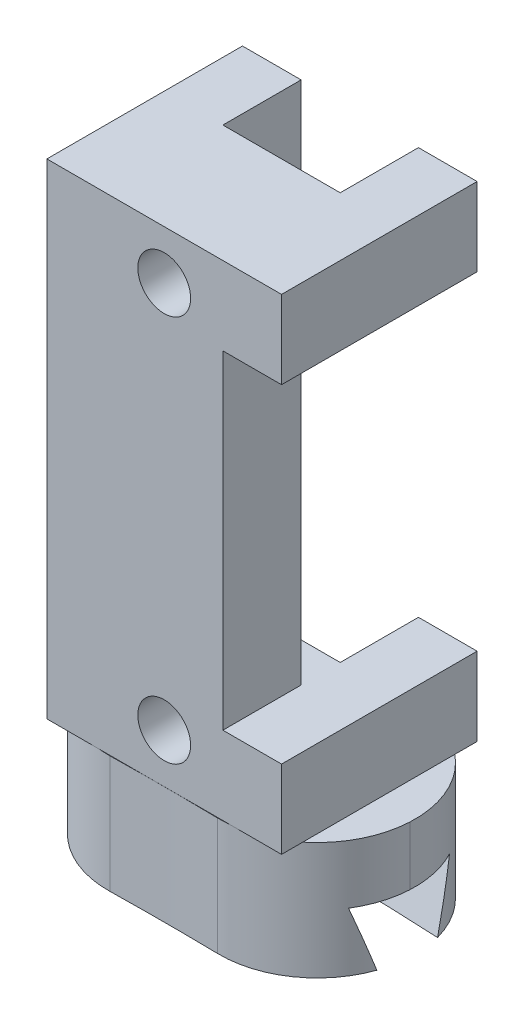
ISO-10303-21;
HEADER;
FILE_DESCRIPTION(('STEP AP214'),'2;1');
FILE_NAME('part.step','',(''),(''),'','','');
FILE_SCHEMA(('AUTOMOTIVE_DESIGN { 1 0 10303 214 1 1 1 1 }'));
ENDSEC;
DATA;
#1=APPLICATION_CONTEXT('core data for automotive mechanical design processes');
#2=APPLICATION_PROTOCOL_DEFINITION('international standard','automotive_design',2000,#1);
#3=PRODUCT_CONTEXT('',#1,'mechanical');
#4=PRODUCT('Part','Part','',(#3));
#5=PRODUCT_RELATED_PRODUCT_CATEGORY('part','',(#4));
#6=PRODUCT_DEFINITION_FORMATION('','',#4);
#7=PRODUCT_DEFINITION_CONTEXT('part definition',#1,'design');
#8=PRODUCT_DEFINITION('design','',#6,#7);
#9=PRODUCT_DEFINITION_SHAPE('','',#8);
#10=(LENGTH_UNIT() NAMED_UNIT(*) SI_UNIT(.MILLI.,.METRE.));
#11=(NAMED_UNIT(*) PLANE_ANGLE_UNIT() SI_UNIT($,.RADIAN.));
#12=(NAMED_UNIT(*) SI_UNIT($,.STERADIAN.) SOLID_ANGLE_UNIT());
#13=UNCERTAINTY_MEASURE_WITH_UNIT(LENGTH_MEASURE(1.E-05),#10,'distance_accuracy_value','');
#14=(GEOMETRIC_REPRESENTATION_CONTEXT(3) GLOBAL_UNCERTAINTY_ASSIGNED_CONTEXT((#13)) GLOBAL_UNIT_ASSIGNED_CONTEXT((#10,
#11,#12)) REPRESENTATION_CONTEXT('',''));
#15=CARTESIAN_POINT('',(0.,0.,0.));
#16=DIRECTION('',(0.,0.,1.));
#17=DIRECTION('',(1.,0.,0.));
#18=AXIS2_PLACEMENT_3D('',#15,#16,#17);
#19=CARTESIAN_POINT('',(7.77188950207718,-5.99999999999999,-148.296485911054));
#20=DIRECTION('',(0.,1.,0.));
#21=DIRECTION('',(0.,0.,1.));
#22=AXIS2_PLACEMENT_3D('',#19,#20,#21);
#23=PLANE('',#22);
#24=CARTESIAN_POINT('',(0.,-5.99999999999999,0.));
#25=DIRECTION('',(0.,1.,0.));
#26=DIRECTION('',(0.,0.,1.));
#27=AXIS2_PLACEMENT_3D('',#24,#25,#26);
#28=CIRCLE('',#27,148.5);
#29=CARTESIAN_POINT('',(7.56723547450989,-5.99999999999999,-148.307069781832));
#30=VERTEX_POINT('',#29);
#31=CARTESIAN_POINT('',(-7.56723547450992,-5.99999999999999,-148.307069781832));
#32=VERTEX_POINT('',#31);
#33=EDGE_CURVE('E253',#30,#32,#28,.T.);
#34=ORIENTED_EDGE('',*,*,#33,.F.);
#35=CARTESIAN_POINT('',(2.85288322082783,-5.99999999999999,-149.972867737229));
#36=DIRECTION('',(0.,1.,0.));
#37=DIRECTION('',(0.,0.,1.));
#38=AXIS2_PLACEMENT_3D('',#35,#36,#37);
#39=CIRCLE('',#38,5.);
#40=CARTESIAN_POINT('',(2.7577871134669,-5.99999999999999,-144.973772145988));
#41=VERTEX_POINT('',#40);
#42=EDGE_CURVE('E67',#30,#41,#39,.F.);
#43=ORIENTED_EDGE('',*,*,#42,.T.);
#44=CARTESIAN_POINT('',(0.,-5.99999999999999,0.));
#45=DIRECTION('',(0.,1.,0.));
#46=DIRECTION('',(0.,0.,1.));
#47=AXIS2_PLACEMENT_3D('',#44,#45,#46);
#48=CIRCLE('',#47,145.);
#49=CARTESIAN_POINT('',(-2.7577871134669,-5.99999999999999,-144.973772145988));
#50=VERTEX_POINT('',#49);
#51=EDGE_CURVE('E124',#41,#50,#48,.T.);
#52=ORIENTED_EDGE('',*,*,#51,.T.);
#53=CARTESIAN_POINT('',(-2.85288322082783,-5.99999999999999,-149.972867737229));
#54=DIRECTION('',(0.,1.,0.));
#55=DIRECTION('',(0.,0.,1.));
#56=AXIS2_PLACEMENT_3D('',#53,#54,#55);
#57=CIRCLE('',#56,5.);
#58=EDGE_CURVE('E205',#50,#32,#57,.F.);
#59=ORIENTED_EDGE('',*,*,#58,.T.);
#60=EDGE_LOOP('',(#34,#43,#52,#59));
#61=FACE_BOUND('',#60,.T.);
#62=ADVANCED_FACE('F43',(#61),#23,.F.);
#63=CARTESIAN_POINT('',(0.,-5.99999999999999,0.));
#64=DIRECTION('',(0.,-1.,0.));
#65=DIRECTION('',(0.,0.,-1.));
#66=AXIS2_PLACEMENT_3D('',#63,#64,#65);
#67=CONICAL_SURFACE('',#66,148.5,0.321750554396643);
#68=CARTESIAN_POINT('',(0.,-2.99999999999999,0.));
#69=DIRECTION('',(0.,1.,0.));
#70=DIRECTION('',(0.,0.,1.));
#71=AXIS2_PLACEMENT_3D('',#68,#69,#70);
#72=CIRCLE('',#71,147.5);
#73=CARTESIAN_POINT('',(7.09680598545688,-2.99999999999999,-147.329173434201));
#74=VERTEX_POINT('',#73);
#75=CARTESIAN_POINT('',(-7.09680598545634,-2.99999999999999,-147.329173434201));
#76=VERTEX_POINT('',#75);
#77=EDGE_CURVE('E247',#74,#76,#72,.T.);
#78=ORIENTED_EDGE('',*,*,#77,.F.);
#79=CARTESIAN_POINT('',(7.09680598545688,-2.99999999999999,-147.329173434201));
#80=CARTESIAN_POINT('',(7.14694345753966,-3.24849777765476,-147.409686408016));
#81=CARTESIAN_POINT('',(7.19411464656061,-3.49749111640178,-147.490487021504));
#82=CARTESIAN_POINT('',(7.28287122221701,-3.99620367637286,-147.652571102377));
#83=CARTESIAN_POINT('',(7.32445882203517,-4.24592256966958,-147.733854365035));
#84=CARTESIAN_POINT('',(7.40243378589243,-4.74601575726446,-147.896874424309));
#85=CARTESIAN_POINT('',(7.43882121411936,-4.99639004343397,-147.978611215316));
#86=CARTESIAN_POINT('',(7.50666706111707,-5.49777389944254,-148.14252749319));
#87=CARTESIAN_POINT('',(7.53812351441111,-5.74878368228539,-148.224707143148));
#88=CARTESIAN_POINT('',(7.56723547450992,-5.99999999999999,-148.307069781832));
#89=B_SPLINE_CURVE_WITH_KNOTS('',3,(#79,#80,#81,#82,#83,#84,#85,#86,#87,#88),.UNSPECIFIED.,.F.,
.F.,(4,2,2,2,4),(0.,0.797920321275331,1.59552342901255,2.39311669075938,3.19102706758133),.UNSPECIFIED.);
#90=EDGE_CURVE('E200',#74,#30,#89,.T.);
#91=ORIENTED_EDGE('',*,*,#90,.T.);
#92=ORIENTED_EDGE('',*,*,#33,.T.);
#93=CARTESIAN_POINT('',(-7.56723547450992,-5.99999999999999,-148.307069781832));
#94=CARTESIAN_POINT('',(-7.53812351441111,-5.74878368228539,-148.224707143148));
#95=CARTESIAN_POINT('',(-7.50666706111707,-5.49777389944255,-148.14252749319));
#96=CARTESIAN_POINT('',(-7.43882121411936,-4.99639004343398,-147.978611215316));
#97=CARTESIAN_POINT('',(-7.40243378589243,-4.74601575726446,-147.896874424309));
#98=CARTESIAN_POINT('',(-7.32445882203517,-4.24592256966958,-147.733854365035));
#99=CARTESIAN_POINT('',(-7.28287122221701,-3.99620367637286,-147.652571102377));
#100=CARTESIAN_POINT('',(-7.19411464656061,-3.49749111640178,-147.490487021504));
#101=CARTESIAN_POINT('',(-7.14694345753966,-3.24849777765476,-147.409686408016));
#102=CARTESIAN_POINT('',(-7.09680598545689,-2.99999999999998,-147.329173434201));
#103=B_SPLINE_CURVE_WITH_KNOTS('',3,(#93,#94,#95,#96,#97,#98,#99,#100,#101,#102),.UNSPECIFIED.,
.F.,.F.,(4,2,2,2,4),(0.,0.797910376821949,1.59550363856878,2.393106746306,3.19102706758133),.UNSPECIFIED.);
#104=EDGE_CURVE('E194',#32,#76,#103,.T.);
#105=ORIENTED_EDGE('',*,*,#104,.T.);
#106=EDGE_LOOP('',(#78,#91,#92,#105));
#107=FACE_BOUND('',#106,.T.);
#108=ADVANCED_FACE('F185',(#107),#67,.T.);
#109=CARTESIAN_POINT('',(7.98123332704895,-2.99999999999999,-152.291004050073));
#110=DIRECTION('',(0.,1.,0.));
#111=DIRECTION('',(0.,0.,1.));
#112=AXIS2_PLACEMENT_3D('',#109,#110,#111);
#113=PLANE('',#112);
#114=CARTESIAN_POINT('',(0.,-2.99999999999999,0.));
#115=DIRECTION('',(0.,1.,0.));
#116=DIRECTION('',(0.,0.,1.));
#117=AXIS2_PLACEMENT_3D('',#114,#115,#116);
#118=CIRCLE('',#117,152.5);
#119=CARTESIAN_POINT('',(7.26406784686396,-2.99999999999999,-152.326896240671));
#120=VERTEX_POINT('',#119);
#121=CARTESIAN_POINT('',(-7.26406784686442,-2.99999999999999,-152.326896240671));
#122=VERTEX_POINT('',#121);
#123=EDGE_CURVE('E245',#120,#122,#118,.T.);
#124=ORIENTED_EDGE('',*,*,#123,.F.);
#125=CARTESIAN_POINT('',(2.85288322082783,-2.99999999999999,-149.972867737229));
#126=DIRECTION('',(0.,1.,0.));
#127=DIRECTION('',(0.,0.,1.));
#128=AXIS2_PLACEMENT_3D('',#125,#126,#127);
#129=CIRCLE('',#128,5.);
#130=CARTESIAN_POINT('',(7.8460308946007,-2.99999999999999,-149.711187956014));
#131=VERTEX_POINT('',#130);
#132=EDGE_CURVE('E262',#120,#131,#129,.F.);
#133=ORIENTED_EDGE('',*,*,#132,.T.);
#134=CARTESIAN_POINT('',(2.85288322082783,-2.99999999999999,-149.972867737229));
#135=DIRECTION('',(0.,1.,0.));
#136=DIRECTION('',(0.,0.,1.));
#137=AXIS2_PLACEMENT_3D('',#134,#135,#136);
#138=CIRCLE('',#137,5.);
#139=EDGE_CURVE('E263',#131,#74,#138,.F.);
#140=ORIENTED_EDGE('',*,*,#139,.T.);
#141=ORIENTED_EDGE('',*,*,#77,.T.);
#142=CARTESIAN_POINT('',(-2.85288322082783,-2.99999999999999,-149.972867737229));
#143=DIRECTION('',(0.,1.,0.));
#144=DIRECTION('',(0.,0.,1.));
#145=AXIS2_PLACEMENT_3D('',#142,#143,#144);
#146=CIRCLE('',#145,5.);
#147=CARTESIAN_POINT('',(-7.8460308946007,-2.99999999999999,-149.711187956014));
#148=VERTEX_POINT('',#147);
#149=EDGE_CURVE('E261',#76,#148,#146,.F.);
#150=ORIENTED_EDGE('',*,*,#149,.T.);
#151=CARTESIAN_POINT('',(-2.85288322082783,-2.99999999999999,-149.972867737229));
#152=DIRECTION('',(0.,1.,0.));
#153=DIRECTION('',(0.,0.,1.));
#154=AXIS2_PLACEMENT_3D('',#151,#152,#153);
#155=CIRCLE('',#154,5.);
#156=EDGE_CURVE('E264',#148,#122,#155,.F.);
#157=ORIENTED_EDGE('',*,*,#156,.T.);
#158=EDGE_LOOP('',(#124,#133,#140,#141,#150,#157));
#159=FACE_BOUND('',#158,.T.);
#160=ADVANCED_FACE('F179',(#159),#113,.F.);
#161=CARTESIAN_POINT('',(0.,-2.99999999999999,0.));
#162=DIRECTION('',(0.,1.,0.));
#163=DIRECTION('',(0.,0.,1.));
#164=AXIS2_PLACEMENT_3D('',#161,#162,#163);
#165=CONICAL_SURFACE('',#164,152.5,0.321750554396643);
#166=CARTESIAN_POINT('',(0.,-5.99999999999999,0.));
#167=DIRECTION('',(0.,1.,0.));
#168=DIRECTION('',(0.,0.,1.));
#169=AXIS2_PLACEMENT_3D('',#166,#167,#168);
#170=CIRCLE('',#169,151.5);
#171=CARTESIAN_POINT('',(7.67198809641304,-5.99999999999999,-151.305619851506));
#172=VERTEX_POINT('',#171);
#173=CARTESIAN_POINT('',(-7.67198809641301,-5.99999999999999,-151.305619851506));
#174=VERTEX_POINT('',#173);
#175=EDGE_CURVE('E240',#172,#174,#170,.T.);
#176=ORIENTED_EDGE('',*,*,#175,.F.);
#177=CARTESIAN_POINT('',(7.67198809641304,-5.99999999999999,-151.305619851506));
#178=CARTESIAN_POINT('',(7.64844865757106,-5.74865741107548,-151.390701569956));
#179=CARTESIAN_POINT('',(7.62249227862881,-5.49754811119247,-151.475821006032));
#180=CARTESIAN_POINT('',(7.56547321684159,-4.99603130632236,-151.646060102086));
#181=CARTESIAN_POINT('',(7.53441270686926,-4.74562354861906,-151.731179746622));
#182=CARTESIAN_POINT('',(7.46689298625176,-4.2455279364022,-151.901417540359));
#183=CARTESIAN_POINT('',(7.43043370124475,-3.99584009185291,-151.986535689522));
#184=CARTESIAN_POINT('',(7.35170588307958,-3.49725585456789,-152.156752708309));
#185=CARTESIAN_POINT('',(7.30943488801477,-3.24835984322292,-152.241851554372));
#186=CARTESIAN_POINT('',(7.26406784686443,-2.99999999999998,-152.326896240671));
#187=B_SPLINE_CURVE_WITH_KNOTS('',3,(#177,#178,#179,#180,#181,#182,#183,#184,#185,#186),
.UNSPECIFIED.,.F.,.F.,(4,2,2,2,4),(0.,0.799180599717231,1.5980218585563,2.39687412152819,
3.19606583610794),.UNSPECIFIED.);
#188=EDGE_CURVE('E164',#172,#120,#187,.T.);
#189=ORIENTED_EDGE('',*,*,#188,.T.);
#190=ORIENTED_EDGE('',*,*,#123,.T.);
#191=CARTESIAN_POINT('',(-7.26406784686442,-2.99999999999999,-152.326896240671));
#192=CARTESIAN_POINT('',(-7.30943488801477,-3.24835984322292,-152.241851554372));
#193=CARTESIAN_POINT('',(-7.35170588307958,-3.4972558545679,-152.156752708309));
#194=CARTESIAN_POINT('',(-7.43043370124475,-3.99584009185291,-151.986535689522));
#195=CARTESIAN_POINT('',(-7.46689298625176,-4.2455279364022,-151.901417540359));
#196=CARTESIAN_POINT('',(-7.53441270686926,-4.74562354861906,-151.731179746622));
#197=CARTESIAN_POINT('',(-7.56547321684159,-4.99603130632237,-151.646060102086));
#198=CARTESIAN_POINT('',(-7.62249227862881,-5.49754811119247,-151.475821006032));
#199=CARTESIAN_POINT('',(-7.64844865757106,-5.74865741107547,-151.390701569956));
#200=CARTESIAN_POINT('',(-7.67198809641305,-5.99999999999998,-151.305619851506));
#201=B_SPLINE_CURVE_WITH_KNOTS('',3,(#191,#192,#193,#194,#195,#196,#197,#198,#199,#200),
.UNSPECIFIED.,.F.,.F.,(4,2,2,2,4),(0.,0.79919171457975,1.59804397755164,2.39688523639071,
3.19606583610793),.UNSPECIFIED.);
#202=EDGE_CURVE('E158',#122,#174,#201,.T.);
#203=ORIENTED_EDGE('',*,*,#202,.T.);
#204=EDGE_LOOP('',(#176,#189,#190,#203));
#205=FACE_BOUND('',#204,.T.);
#206=ADVANCED_FACE('F173',(#205),#165,.F.);
#207=CARTESIAN_POINT('',(7.92889737080601,-5.99999999999999,-151.292374515318));
#208=DIRECTION('',(0.,1.,0.));
#209=DIRECTION('',(0.,0.,1.));
#210=AXIS2_PLACEMENT_3D('',#207,#208,#209);
#211=PLANE('',#210);
#212=CARTESIAN_POINT('',(0.,-5.99999999999999,0.));
#213=DIRECTION('',(0.,1.,0.));
#214=DIRECTION('',(0.,0.,1.));
#215=AXIS2_PLACEMENT_3D('',#212,#213,#214);
#216=CIRCLE('',#215,155.);
#217=CARTESIAN_POINT('',(2.94797932818876,-5.99999999999999,-154.97196332847));
#218=VERTEX_POINT('',#217);
#219=CARTESIAN_POINT('',(-2.94797932818876,-5.99999999999999,-154.97196332847));
#220=VERTEX_POINT('',#219);
#221=EDGE_CURVE('E234',#218,#220,#216,.T.);
#222=ORIENTED_EDGE('',*,*,#221,.F.);
#223=CARTESIAN_POINT('',(2.85288322082783,-5.99999999999999,-149.972867737229));
#224=DIRECTION('',(0.,1.,0.));
#225=DIRECTION('',(0.,0.,1.));
#226=AXIS2_PLACEMENT_3D('',#223,#224,#225);
#227=CIRCLE('',#226,5.);
#228=EDGE_CURVE('E156',#218,#172,#227,.F.);
#229=ORIENTED_EDGE('',*,*,#228,.T.);
#230=ORIENTED_EDGE('',*,*,#175,.T.);
#231=CARTESIAN_POINT('',(-2.85288322082783,-5.99999999999999,-149.972867737229));
#232=DIRECTION('',(0.,1.,0.));
#233=DIRECTION('',(0.,0.,1.));
#234=AXIS2_PLACEMENT_3D('',#231,#232,#233);
#235=CIRCLE('',#234,5.);
#236=EDGE_CURVE('E154',#174,#220,#235,.F.);
#237=ORIENTED_EDGE('',*,*,#236,.T.);
#238=EDGE_LOOP('',(#222,#229,#230,#237));
#239=FACE_BOUND('',#238,.T.);
#240=ADVANCED_FACE('F178',(#239),#211,.F.);
#241=CARTESIAN_POINT('',(0.,11.,0.));
#242=DIRECTION('',(0.,1.,0.));
#243=DIRECTION('',(0.,0.,1.));
#244=AXIS2_PLACEMENT_3D('',#241,#242,#243);
#245=CYLINDRICAL_SURFACE('',#244,155.);
#246=CARTESIAN_POINT('',(0.,0.,0.));
#247=DIRECTION('',(0.,1.,0.));
#248=DIRECTION('',(0.,0.,1.));
#249=AXIS2_PLACEMENT_3D('',#246,#247,#248);
#250=CIRCLE('',#249,155.);
#251=CARTESIAN_POINT('',(2.94797932818876,0.,-154.97196332847));
#252=VERTEX_POINT('',#251);
#253=CARTESIAN_POINT('',(-2.94797932818876,0.,-154.97196332847));
#254=VERTEX_POINT('',#253);
#255=EDGE_CURVE('E133',#252,#254,#250,.T.);
#256=ORIENTED_EDGE('',*,*,#255,.F.);
#257=DIRECTION('',(0.,1.,0.));
#258=VECTOR('',#257,1.);
#259=CARTESIAN_POINT('',(2.94797932818876,11.,-154.97196332847));
#260=LINE('',#259,#258);
#261=EDGE_CURVE('E151',#252,#218,#260,.F.);
#262=ORIENTED_EDGE('',*,*,#261,.T.);
#263=ORIENTED_EDGE('',*,*,#221,.T.);
#264=DIRECTION('',(0.,1.,0.));
#265=VECTOR('',#264,1.);
#266=CARTESIAN_POINT('',(-2.94797932818876,11.,-154.97196332847));
#267=LINE('',#266,#265);
#268=EDGE_CURVE('E144',#220,#254,#267,.T.);
#269=ORIENTED_EDGE('',*,*,#268,.T.);
#270=EDGE_LOOP('',(#256,#262,#263,#269));
#271=FACE_BOUND('',#270,.T.);
#272=ADVANCED_FACE('F221',(#271),#245,.T.);
#273=CARTESIAN_POINT('',(8.11207321765631,0.,-154.787577886959));
#274=DIRECTION('',(0.,-1.,0.));
#275=DIRECTION('',(0.,0.,-1.));
#276=AXIS2_PLACEMENT_3D('',#273,#274,#275);
#277=PLANE('',#276);
#278=CARTESIAN_POINT('',(2.85288322082783,0.,-149.972867737229));
#279=DIRECTION('',(0.,-1.,0.));
#280=DIRECTION('',(0.,0.,-1.));
#281=AXIS2_PLACEMENT_3D('',#278,#279,#280);
#282=CIRCLE('',#281,5.);
#283=CARTESIAN_POINT('',(2.7577871134669,0.,-144.973772145988));
#284=VERTEX_POINT('',#283);
#285=CARTESIAN_POINT('',(7.8460308946007,0.,-149.711187956014));
#286=VERTEX_POINT('',#285);
#287=EDGE_CURVE('E129',#284,#286,#282,.F.);
#288=ORIENTED_EDGE('',*,*,#287,.T.);
#289=CARTESIAN_POINT('',(2.85288322082783,0.,-149.972867737229));
#290=DIRECTION('',(0.,-1.,0.));
#291=DIRECTION('',(0.,0.,-1.));
#292=AXIS2_PLACEMENT_3D('',#289,#290,#291);
#293=CIRCLE('',#292,5.);
#294=EDGE_CURVE('E141',#286,#252,#293,.F.);
#295=ORIENTED_EDGE('',*,*,#294,.T.);
#296=ORIENTED_EDGE('',*,*,#255,.T.);
#297=CARTESIAN_POINT('',(-2.85288322082783,0.,-149.972867737229));
#298=DIRECTION('',(0.,-1.,0.));
#299=DIRECTION('',(0.,0.,-1.));
#300=AXIS2_PLACEMENT_3D('',#297,#298,#299);
#301=CIRCLE('',#300,5.);
#302=CARTESIAN_POINT('',(-7.8460308946007,0.,-149.711187956014));
#303=VERTEX_POINT('',#302);
#304=EDGE_CURVE('E142',#254,#303,#301,.F.);
#305=ORIENTED_EDGE('',*,*,#304,.T.);
#306=CARTESIAN_POINT('',(-2.85288322082783,0.,-149.972867737229));
#307=DIRECTION('',(0.,-1.,0.));
#308=DIRECTION('',(0.,0.,-1.));
#309=AXIS2_PLACEMENT_3D('',#306,#307,#308);
#310=CIRCLE('',#309,5.);
#311=CARTESIAN_POINT('',(-2.7577871134669,0.,-144.973772145988));
#312=VERTEX_POINT('',#311);
#313=EDGE_CURVE('E132',#303,#312,#310,.F.);
#314=ORIENTED_EDGE('',*,*,#313,.T.);
#315=CARTESIAN_POINT('',(0.,0.,0.));
#316=DIRECTION('',(0.,1.,0.));
#317=DIRECTION('',(0.,0.,1.));
#318=AXIS2_PLACEMENT_3D('',#315,#316,#317);
#319=CIRCLE('',#318,145.);
#320=EDGE_CURVE('E123',#284,#312,#319,.T.);
#321=ORIENTED_EDGE('',*,*,#320,.F.);
#322=EDGE_LOOP('',(#288,#295,#296,#305,#314,#321));
#323=FACE_BOUND('',#322,.T.);
#324=ADVANCED_FACE('F128',(#323),#277,.F.);
#325=CARTESIAN_POINT('',(0.,11.,0.));
#326=DIRECTION('',(0.,1.,0.));
#327=DIRECTION('',(0.,0.,1.));
#328=AXIS2_PLACEMENT_3D('',#325,#326,#327);
#329=CYLINDRICAL_SURFACE('',#328,145.);
#330=ORIENTED_EDGE('',*,*,#51,.F.);
#331=DIRECTION('',(0.,1.,0.));
#332=VECTOR('',#331,1.);
#333=CARTESIAN_POINT('',(2.7577871134669,11.,-144.973772145988));
#334=LINE('',#333,#332);
#335=EDGE_CURVE('E12',#41,#284,#334,.T.);
#336=ORIENTED_EDGE('',*,*,#335,.T.);
#337=ORIENTED_EDGE('',*,*,#320,.T.);
#338=DIRECTION('',(0.,1.,0.));
#339=VECTOR('',#338,1.);
#340=CARTESIAN_POINT('',(-2.7577871134669,11.,-144.973772145988));
#341=LINE('',#340,#339);
#342=EDGE_CURVE('E53',#312,#50,#341,.F.);
#343=ORIENTED_EDGE('',*,*,#342,.T.);
#344=EDGE_LOOP('',(#330,#336,#337,#343));
#345=FACE_BOUND('',#344,.T.);
#346=ADVANCED_FACE('F122',(#345),#329,.F.);
#347=CARTESIAN_POINT('',(2.85288322082783,11.,-149.972867737229));
#348=DIRECTION('',(0.,1.,0.));
#349=DIRECTION('',(0.,0.,1.));
#350=AXIS2_PLACEMENT_3D('',#347,#348,#349);
#351=CYLINDRICAL_SURFACE('',#350,5.);
#352=ORIENTED_EDGE('',*,*,#90,.F.);
#353=ORIENTED_EDGE('',*,*,#139,.F.);
#354=DIRECTION('',(0.,-1.,0.));
#355=VECTOR('',#354,1.);
#356=CARTESIAN_POINT('',(7.8460308946007,-5.99999999999999,-149.711187956014));
#357=LINE('',#356,#355);
#358=EDGE_CURVE('E139',#286,#131,#357,.T.);
#359=ORIENTED_EDGE('',*,*,#358,.F.);
#360=ORIENTED_EDGE('',*,*,#287,.F.);
#361=ORIENTED_EDGE('',*,*,#335,.F.);
#362=ORIENTED_EDGE('',*,*,#42,.F.);
#363=EDGE_LOOP('',(#352,#353,#359,#360,#361,#362));
#364=FACE_BOUND('',#363,.T.);
#365=ADVANCED_FACE('F136',(#364),#351,.T.);
#366=CARTESIAN_POINT('',(2.85288322082783,11.,-149.972867737229));
#367=DIRECTION('',(0.,1.,0.));
#368=DIRECTION('',(0.,0.,1.));
#369=AXIS2_PLACEMENT_3D('',#366,#367,#368);
#370=CYLINDRICAL_SURFACE('',#369,5.);
#371=ORIENTED_EDGE('',*,*,#228,.F.);
#372=ORIENTED_EDGE('',*,*,#261,.F.);
#373=ORIENTED_EDGE('',*,*,#294,.F.);
#374=ORIENTED_EDGE('',*,*,#358,.T.);
#375=ORIENTED_EDGE('',*,*,#132,.F.);
#376=ORIENTED_EDGE('',*,*,#188,.F.);
#377=EDGE_LOOP('',(#371,#372,#373,#374,#375,#376));
#378=FACE_BOUND('',#377,.T.);
#379=ADVANCED_FACE('F190',(#378),#370,.T.);
#380=CARTESIAN_POINT('',(-2.85288322082783,11.,-149.972867737229));
#381=DIRECTION('',(0.,1.,0.));
#382=DIRECTION('',(0.,0.,1.));
#383=AXIS2_PLACEMENT_3D('',#380,#381,#382);
#384=CYLINDRICAL_SURFACE('',#383,5.);
#385=DIRECTION('',(0.,1.,0.));
#386=VECTOR('',#385,1.);
#387=CARTESIAN_POINT('',(-7.8460308946007,0.,-149.711187956014));
#388=LINE('',#387,#386);
#389=EDGE_CURVE('E48',#148,#303,#388,.T.);
#390=ORIENTED_EDGE('',*,*,#389,.F.);
#391=ORIENTED_EDGE('',*,*,#149,.F.);
#392=ORIENTED_EDGE('',*,*,#104,.F.);
#393=ORIENTED_EDGE('',*,*,#58,.F.);
#394=ORIENTED_EDGE('',*,*,#342,.F.);
#395=ORIENTED_EDGE('',*,*,#313,.F.);
#396=EDGE_LOOP('',(#390,#391,#392,#393,#394,#395));
#397=FACE_BOUND('',#396,.T.);
#398=ADVANCED_FACE('F45',(#397),#384,.T.);
#399=CARTESIAN_POINT('',(-2.85288322082783,11.,-149.972867737229));
#400=DIRECTION('',(0.,1.,0.));
#401=DIRECTION('',(0.,0.,1.));
#402=AXIS2_PLACEMENT_3D('',#399,#400,#401);
#403=CYLINDRICAL_SURFACE('',#402,5.);
#404=ORIENTED_EDGE('',*,*,#156,.F.);
#405=ORIENTED_EDGE('',*,*,#389,.T.);
#406=ORIENTED_EDGE('',*,*,#304,.F.);
#407=ORIENTED_EDGE('',*,*,#268,.F.);
#408=ORIENTED_EDGE('',*,*,#236,.F.);
#409=ORIENTED_EDGE('',*,*,#202,.F.);
#410=EDGE_LOOP('',(#404,#405,#406,#407,#408,#409));
#411=FACE_BOUND('',#410,.T.);
#412=ADVANCED_FACE('F170',(#411),#403,.T.);
#413=CLOSED_SHELL('',(#62,#108,#160,#206,#240,#272,#324,#346,#365,#379,#398,#412));
#414=MANIFOLD_SOLID_BREP('B2',#413);
#415=CARTESIAN_POINT('',(6.,24.8,-145.));
#416=DIRECTION('',(-1.,0.,0.));
#417=DIRECTION('',(0.,-1.,0.));
#418=AXIS2_PLACEMENT_3D('',#415,#416,#417);
#419=PLANE('',#418);
#420=DIRECTION('',(0.,1.,0.));
#421=VECTOR('',#420,1.);
#422=CARTESIAN_POINT('',(6.,24.8,-145.));
#423=LINE('',#422,#421);
#424=CARTESIAN_POINT('',(6.,20.8,-145.));
#425=VERTEX_POINT('',#424);
#426=CARTESIAN_POINT('',(6.,24.8,-145.));
#427=VERTEX_POINT('',#426);
#428=EDGE_CURVE('E516',#425,#427,#423,.T.);
#429=ORIENTED_EDGE('',*,*,#428,.F.);
#430=DIRECTION('',(0.,0.,1.));
#431=VECTOR('',#430,1.);
#432=CARTESIAN_POINT('',(6.,20.8,-149.));
#433=LINE('',#432,#431);
#434=CARTESIAN_POINT('',(6.,20.8,-155.));
#435=VERTEX_POINT('',#434);
#436=EDGE_CURVE('E568',#435,#425,#433,.T.);
#437=ORIENTED_EDGE('',*,*,#436,.F.);
#438=DIRECTION('',(0.,1.,0.));
#439=VECTOR('',#438,1.);
#440=CARTESIAN_POINT('',(6.,24.8,-155.));
#441=LINE('',#440,#439);
#442=CARTESIAN_POINT('',(6.,24.8,-155.));
#443=VERTEX_POINT('',#442);
#444=EDGE_CURVE('E530',#435,#443,#441,.T.);
#445=ORIENTED_EDGE('',*,*,#444,.T.);
#446=DIRECTION('',(0.,0.,-1.));
#447=VECTOR('',#446,1.);
#448=CARTESIAN_POINT('',(6.,24.8,-145.));
#449=LINE('',#448,#447);
#450=EDGE_CURVE('E539',#427,#443,#449,.T.);
#451=ORIENTED_EDGE('',*,*,#450,.F.);
#452=EDGE_LOOP('',(#429,#437,#445,#451));
#453=FACE_BOUND('',#452,.T.);
#454=ADVANCED_FACE('F343',(#453),#419,.F.);
#455=CARTESIAN_POINT('',(0.,0.,-155.));
#456=DIRECTION('',(0.,0.,1.));
#457=DIRECTION('',(1.,0.,0.));
#458=AXIS2_PLACEMENT_3D('',#455,#456,#457);
#459=PLANE('',#458);
#460=DIRECTION('',(1.,0.,0.));
#461=VECTOR('',#460,1.);
#462=CARTESIAN_POINT('',(-6.,20.8,-155.));
#463=LINE('',#462,#461);
#464=CARTESIAN_POINT('',(3.,20.8,-155.));
#465=VERTEX_POINT('',#464);
#466=EDGE_CURVE('E559',#465,#435,#463,.T.);
#467=ORIENTED_EDGE('',*,*,#466,.F.);
#468=DIRECTION('',(0.,-1.,0.));
#469=VECTOR('',#468,1.);
#470=CARTESIAN_POINT('',(3.,24.8,-155.));
#471=LINE('',#470,#469);
#472=CARTESIAN_POINT('',(3.,24.8,-155.));
#473=VERTEX_POINT('',#472);
#474=EDGE_CURVE('E603',#473,#465,#471,.T.);
#475=ORIENTED_EDGE('',*,*,#474,.F.);
#476=DIRECTION('',(-1.,0.,0.));
#477=VECTOR('',#476,1.);
#478=CARTESIAN_POINT('',(-6.,24.8,-155.));
#479=LINE('',#478,#477);
#480=EDGE_CURVE('E514',#443,#473,#479,.T.);
#481=ORIENTED_EDGE('',*,*,#480,.F.);
#482=ORIENTED_EDGE('',*,*,#444,.F.);
#483=EDGE_LOOP('',(#467,#475,#481,#482));
#484=FACE_BOUND('',#483,.T.);
#485=ADVANCED_FACE('F665',(#484),#459,.F.);
#486=DIRECTION('',(1.,0.,0.));
#487=VECTOR('',#486,1.);
#488=CARTESIAN_POINT('',(-6.,0.,-155.));
#489=LINE('',#488,#487);
#490=CARTESIAN_POINT('',(3.,0.,-155.));
#491=VERTEX_POINT('',#490);
#492=CARTESIAN_POINT('',(6.,0.,-155.));
#493=VERTEX_POINT('',#492);
#494=EDGE_CURVE('E526',#491,#493,#489,.T.);
#495=ORIENTED_EDGE('',*,*,#494,.F.);
#496=CARTESIAN_POINT('',(3.,4.00000000000001,-155.));
#497=VERTEX_POINT('',#496);
#498=EDGE_CURVE('E605',#497,#491,#471,.T.);
#499=ORIENTED_EDGE('',*,*,#498,.F.);
#500=DIRECTION('',(1.,0.,0.));
#501=VECTOR('',#500,1.);
#502=CARTESIAN_POINT('',(-6.00000000000001,4.,-155.));
#503=LINE('',#502,#501);
#504=CARTESIAN_POINT('',(6.,4.00000000000001,-155.));
#505=VERTEX_POINT('',#504);
#506=EDGE_CURVE('E494',#497,#505,#503,.T.);
#507=ORIENTED_EDGE('',*,*,#506,.T.);
#508=EDGE_CURVE('E531',#493,#505,#441,.T.);
#509=ORIENTED_EDGE('',*,*,#508,.F.);
#510=EDGE_LOOP('',(#495,#499,#507,#509));
#511=FACE_BOUND('',#510,.T.);
#512=ADVANCED_FACE('F631',(#511),#459,.F.);
#513=CARTESIAN_POINT('',(0.,22.3,-155.));
#514=DIRECTION('',(0.,0.,1.));
#515=DIRECTION('',(1.,0.,0.));
#516=AXIS2_PLACEMENT_3D('',#513,#514,#515);
#517=CYLINDRICAL_SURFACE('',#516,1.35);
#518=CARTESIAN_POINT('',(0.,22.3,-145.));
#519=DIRECTION('',(0.,0.,1.));
#520=DIRECTION('',(1.,0.,0.));
#521=AXIS2_PLACEMENT_3D('',#518,#519,#520);
#522=CIRCLE('',#521,1.35);
#523=CARTESIAN_POINT('',(1.35,22.3,-145.));
#524=VERTEX_POINT('',#523);
#525=EDGE_CURVE('E506',#524,#524,#522,.T.);
#526=ORIENTED_EDGE('',*,*,#525,.T.);
#527=EDGE_LOOP('',(#526));
#528=FACE_BOUND('',#527,.T.);
#529=CARTESIAN_POINT('',(0.,22.3,-151.));
#530=DIRECTION('',(0.,0.,-1.));
#531=DIRECTION('',(-1.,0.,0.));
#532=AXIS2_PLACEMENT_3D('',#529,#530,#531);
#533=CIRCLE('',#532,1.35);
#534=CARTESIAN_POINT('',(-1.35,22.3,-151.));
#535=VERTEX_POINT('',#534);
#536=EDGE_CURVE('E581',#535,#535,#533,.F.);
#537=ORIENTED_EDGE('',*,*,#536,.F.);
#538=EDGE_LOOP('',(#537));
#539=FACE_BOUND('',#538,.T.);
#540=ADVANCED_FACE('F652',(#528,#539),#517,.F.);
#541=CARTESIAN_POINT('',(0.,2.5,-155.));
#542=DIRECTION('',(0.,0.,1.));
#543=DIRECTION('',(1.,0.,0.));
#544=AXIS2_PLACEMENT_3D('',#541,#542,#543);
#545=CYLINDRICAL_SURFACE('',#544,1.35);
#546=CARTESIAN_POINT('',(0.,2.5,-145.));
#547=DIRECTION('',(0.,0.,1.));
#548=DIRECTION('',(1.,0.,0.));
#549=AXIS2_PLACEMENT_3D('',#546,#547,#548);
#550=CIRCLE('',#549,1.35);
#551=CARTESIAN_POINT('',(1.35,2.5,-145.));
#552=VERTEX_POINT('',#551);
#553=EDGE_CURVE('E503',#552,#552,#550,.T.);
#554=ORIENTED_EDGE('',*,*,#553,.T.);
#555=EDGE_LOOP('',(#554));
#556=FACE_BOUND('',#555,.T.);
#557=CARTESIAN_POINT('',(0.,2.5,-151.));
#558=DIRECTION('',(0.,0.,-1.));
#559=DIRECTION('',(-1.,0.,0.));
#560=AXIS2_PLACEMENT_3D('',#557,#558,#559);
#561=CIRCLE('',#560,1.35);
#562=CARTESIAN_POINT('',(-1.35000000000001,2.5,-151.));
#563=VERTEX_POINT('',#562);
#564=EDGE_CURVE('E584',#563,#563,#561,.F.);
#565=ORIENTED_EDGE('',*,*,#564,.F.);
#566=EDGE_LOOP('',(#565));
#567=FACE_BOUND('',#566,.T.);
#568=ADVANCED_FACE('F649',(#556,#567),#545,.F.);
#569=CARTESIAN_POINT('',(-3.,24.8,-155.));
#570=VERTEX_POINT('',#569);
#571=CARTESIAN_POINT('',(-6.,24.8,-155.));
#572=VERTEX_POINT('',#571);
#573=EDGE_CURVE('E534',#570,#572,#479,.T.);
#574=ORIENTED_EDGE('',*,*,#573,.F.);
#575=DIRECTION('',(0.,1.,0.));
#576=VECTOR('',#575,1.);
#577=CARTESIAN_POINT('',(-3.,24.8,-155.));
#578=LINE('',#577,#576);
#579=CARTESIAN_POINT('',(-3.,20.8,-155.));
#580=VERTEX_POINT('',#579);
#581=EDGE_CURVE('E602',#580,#570,#578,.T.);
#582=ORIENTED_EDGE('',*,*,#581,.F.);
#583=CARTESIAN_POINT('',(-6.,20.8,-155.));
#584=VERTEX_POINT('',#583);
#585=EDGE_CURVE('E560',#584,#580,#463,.T.);
#586=ORIENTED_EDGE('',*,*,#585,.F.);
#587=DIRECTION('',(0.,-1.,0.));
#588=VECTOR('',#587,1.);
#589=CARTESIAN_POINT('',(-6.,24.8,-155.));
#590=LINE('',#589,#588);
#591=EDGE_CURVE('E523',#572,#584,#590,.T.);
#592=ORIENTED_EDGE('',*,*,#591,.F.);
#593=EDGE_LOOP('',(#574,#582,#586,#592));
#594=FACE_BOUND('',#593,.T.);
#595=ADVANCED_FACE('F651',(#594),#459,.F.);
#596=CARTESIAN_POINT('',(-6.,24.8,-145.));
#597=DIRECTION('',(1.,0.,0.));
#598=DIRECTION('',(0.,1.,0.));
#599=AXIS2_PLACEMENT_3D('',#596,#597,#598);
#600=PLANE('',#599);
#601=ORIENTED_EDGE('',*,*,#591,.T.);
#602=DIRECTION('',(0.,0.,1.));
#603=VECTOR('',#602,1.);
#604=CARTESIAN_POINT('',(-6.,20.8,-149.));
#605=LINE('',#604,#603);
#606=CARTESIAN_POINT('',(-6.,20.8,-149.));
#607=VERTEX_POINT('',#606);
#608=EDGE_CURVE('E495',#584,#607,#605,.T.);
#609=ORIENTED_EDGE('',*,*,#608,.T.);
#610=DIRECTION('',(0.,-1.,0.));
#611=VECTOR('',#610,1.);
#612=CARTESIAN_POINT('',(-6.,20.8,-149.));
#613=LINE('',#612,#611);
#614=CARTESIAN_POINT('',(-6.00000000000001,4.,-149.));
#615=VERTEX_POINT('',#614);
#616=EDGE_CURVE('E570',#607,#615,#613,.T.);
#617=ORIENTED_EDGE('',*,*,#616,.T.);
#618=DIRECTION('',(0.,0.,-1.));
#619=VECTOR('',#618,1.);
#620=CARTESIAN_POINT('',(-6.00000000000001,4.,-149.));
#621=LINE('',#620,#619);
#622=CARTESIAN_POINT('',(-6.00000000000001,4.,-155.));
#623=VERTEX_POINT('',#622);
#624=EDGE_CURVE('E492',#615,#623,#621,.T.);
#625=ORIENTED_EDGE('',*,*,#624,.T.);
#626=CARTESIAN_POINT('',(-6.,0.,-155.));
#627=VERTEX_POINT('',#626);
#628=EDGE_CURVE('E509',#623,#627,#590,.T.);
#629=ORIENTED_EDGE('',*,*,#628,.T.);
#630=DIRECTION('',(0.,0.,-1.));
#631=VECTOR('',#630,1.);
#632=CARTESIAN_POINT('',(-6.,0.,-145.));
#633=LINE('',#632,#631);
#634=CARTESIAN_POINT('',(-6.,0.,-145.));
#635=VERTEX_POINT('',#634);
#636=EDGE_CURVE('E545',#635,#627,#633,.T.);
#637=ORIENTED_EDGE('',*,*,#636,.F.);
#638=DIRECTION('',(0.,-1.,0.));
#639=VECTOR('',#638,1.);
#640=CARTESIAN_POINT('',(-6.,24.8,-145.));
#641=LINE('',#640,#639);
#642=CARTESIAN_POINT('',(-6.,24.8,-145.));
#643=VERTEX_POINT('',#642);
#644=EDGE_CURVE('E510',#643,#635,#641,.T.);
#645=ORIENTED_EDGE('',*,*,#644,.F.);
#646=DIRECTION('',(0.,0.,-1.));
#647=VECTOR('',#646,1.);
#648=CARTESIAN_POINT('',(-6.,24.8,-145.));
#649=LINE('',#648,#647);
#650=EDGE_CURVE('E522',#643,#572,#649,.T.);
#651=ORIENTED_EDGE('',*,*,#650,.T.);
#652=EDGE_LOOP('',(#601,#609,#617,#625,#629,#637,#645,#651));
#653=FACE_BOUND('',#652,.T.);
#654=ADVANCED_FACE('F345',(#653),#600,.F.);
#655=CARTESIAN_POINT('',(-6.,0.,-145.));
#656=DIRECTION('',(0.,1.,0.));
#657=DIRECTION('',(0.,0.,1.));
#658=AXIS2_PLACEMENT_3D('',#655,#656,#657);
#659=PLANE('',#658);
#660=DIRECTION('',(-1.,0.,0.));
#661=VECTOR('',#660,1.);
#662=CARTESIAN_POINT('',(3.,0.,-151.));
#663=LINE('',#662,#661);
#664=CARTESIAN_POINT('',(3.,0.,-151.));
#665=VERTEX_POINT('',#664);
#666=CARTESIAN_POINT('',(-3.,0.,-151.));
#667=VERTEX_POINT('',#666);
#668=EDGE_CURVE('E609',#665,#667,#663,.T.);
#669=ORIENTED_EDGE('',*,*,#668,.F.);
#670=DIRECTION('',(0.,0.,-1.));
#671=VECTOR('',#670,1.);
#672=CARTESIAN_POINT('',(3.,0.,-151.));
#673=LINE('',#672,#671);
#674=EDGE_CURVE('E590',#665,#491,#673,.T.);
#675=ORIENTED_EDGE('',*,*,#674,.T.);
#676=ORIENTED_EDGE('',*,*,#494,.T.);
#677=DIRECTION('',(0.,0.,-1.));
#678=VECTOR('',#677,1.);
#679=CARTESIAN_POINT('',(6.,0.,-145.));
#680=LINE('',#679,#678);
#681=CARTESIAN_POINT('',(6.,0.,-145.));
#682=VERTEX_POINT('',#681);
#683=EDGE_CURVE('E542',#682,#493,#680,.T.);
#684=ORIENTED_EDGE('',*,*,#683,.F.);
#685=DIRECTION('',(1.,0.,0.));
#686=VECTOR('',#685,1.);
#687=CARTESIAN_POINT('',(-6.,0.,-145.));
#688=LINE('',#687,#686);
#689=EDGE_CURVE('E513',#635,#682,#688,.T.);
#690=ORIENTED_EDGE('',*,*,#689,.F.);
#691=ORIENTED_EDGE('',*,*,#636,.T.);
#692=CARTESIAN_POINT('',(-3.,0.,-155.));
#693=VERTEX_POINT('',#692);
#694=EDGE_CURVE('E527',#627,#693,#489,.T.);
#695=ORIENTED_EDGE('',*,*,#694,.T.);
#696=DIRECTION('',(0.,0.,-1.));
#697=VECTOR('',#696,1.);
#698=CARTESIAN_POINT('',(-3.,0.,-151.));
#699=LINE('',#698,#697);
#700=EDGE_CURVE('E593',#667,#693,#699,.T.);
#701=ORIENTED_EDGE('',*,*,#700,.F.);
#702=EDGE_LOOP('',(#669,#675,#676,#684,#690,#691,#695,#701));
#703=FACE_BOUND('',#702,.T.);
#704=ADVANCED_FACE('F639',(#703),#659,.F.);
#705=DIRECTION('',(0.,0.,-1.));
#706=VECTOR('',#705,1.);
#707=CARTESIAN_POINT('',(6.,4.,-149.));
#708=LINE('',#707,#706);
#709=CARTESIAN_POINT('',(6.,4.,-145.));
#710=VERTEX_POINT('',#709);
#711=EDGE_CURVE('E571',#710,#505,#708,.T.);
#712=ORIENTED_EDGE('',*,*,#711,.F.);
#713=EDGE_CURVE('E517',#682,#710,#423,.T.);
#714=ORIENTED_EDGE('',*,*,#713,.F.);
#715=ORIENTED_EDGE('',*,*,#683,.T.);
#716=ORIENTED_EDGE('',*,*,#508,.T.);
#717=EDGE_LOOP('',(#712,#714,#715,#716));
#718=FACE_BOUND('',#717,.T.);
#719=ADVANCED_FACE('F627',(#718),#419,.F.);
#720=CARTESIAN_POINT('',(-6.,24.8,-145.));
#721=DIRECTION('',(0.,-1.,0.));
#722=DIRECTION('',(0.,0.,-1.));
#723=AXIS2_PLACEMENT_3D('',#720,#721,#722);
#724=PLANE('',#723);
#725=ORIENTED_EDGE('',*,*,#480,.T.);
#726=DIRECTION('',(0.,0.,-1.));
#727=VECTOR('',#726,1.);
#728=CARTESIAN_POINT('',(3.,24.8,-151.));
#729=LINE('',#728,#727);
#730=CARTESIAN_POINT('',(3.,24.8,-151.));
#731=VERTEX_POINT('',#730);
#732=EDGE_CURVE('E589',#731,#473,#729,.T.);
#733=ORIENTED_EDGE('',*,*,#732,.F.);
#734=DIRECTION('',(1.,0.,0.));
#735=VECTOR('',#734,1.);
#736=CARTESIAN_POINT('',(3.,24.8,-151.));
#737=LINE('',#736,#735);
#738=CARTESIAN_POINT('',(-3.,24.8,-151.));
#739=VERTEX_POINT('',#738);
#740=EDGE_CURVE('E594',#739,#731,#737,.T.);
#741=ORIENTED_EDGE('',*,*,#740,.F.);
#742=DIRECTION('',(0.,0.,-1.));
#743=VECTOR('',#742,1.);
#744=CARTESIAN_POINT('',(-3.,24.8,-151.));
#745=LINE('',#744,#743);
#746=EDGE_CURVE('E596',#739,#570,#745,.T.);
#747=ORIENTED_EDGE('',*,*,#746,.T.);
#748=ORIENTED_EDGE('',*,*,#573,.T.);
#749=ORIENTED_EDGE('',*,*,#650,.F.);
#750=DIRECTION('',(-1.,0.,0.));
#751=VECTOR('',#750,1.);
#752=CARTESIAN_POINT('',(-6.,24.8,-145.));
#753=LINE('',#752,#751);
#754=EDGE_CURVE('E520',#427,#643,#753,.T.);
#755=ORIENTED_EDGE('',*,*,#754,.F.);
#756=ORIENTED_EDGE('',*,*,#450,.T.);
#757=EDGE_LOOP('',(#725,#733,#741,#747,#748,#749,#755,#756));
#758=FACE_BOUND('',#757,.T.);
#759=ADVANCED_FACE('F674',(#758),#724,.F.);
#760=CARTESIAN_POINT('',(0.,0.,-145.));
#761=DIRECTION('',(0.,0.,1.));
#762=DIRECTION('',(1.,0.,0.));
#763=AXIS2_PLACEMENT_3D('',#760,#761,#762);
#764=PLANE('',#763);
#765=DIRECTION('',(-1.,0.,0.));
#766=VECTOR('',#765,1.);
#767=CARTESIAN_POINT('',(0.,20.8,-145.));
#768=LINE('',#767,#766);
#769=CARTESIAN_POINT('',(3.,20.8,-145.));
#770=VERTEX_POINT('',#769);
#771=EDGE_CURVE('E612',#425,#770,#768,.T.);
#772=ORIENTED_EDGE('',*,*,#771,.F.);
#773=ORIENTED_EDGE('',*,*,#428,.T.);
#774=ORIENTED_EDGE('',*,*,#754,.T.);
#775=ORIENTED_EDGE('',*,*,#644,.T.);
#776=ORIENTED_EDGE('',*,*,#689,.T.);
#777=ORIENTED_EDGE('',*,*,#713,.T.);
#778=DIRECTION('',(1.,0.,0.));
#779=VECTOR('',#778,1.);
#780=CARTESIAN_POINT('',(0.,4.,-145.));
#781=LINE('',#780,#779);
#782=CARTESIAN_POINT('',(3.,4.,-145.));
#783=VERTEX_POINT('',#782);
#784=EDGE_CURVE('E615',#783,#710,#781,.T.);
#785=ORIENTED_EDGE('',*,*,#784,.F.);
#786=DIRECTION('',(0.,-1.,0.));
#787=VECTOR('',#786,1.);
#788=CARTESIAN_POINT('',(3.,0.,-145.));
#789=LINE('',#788,#787);
#790=EDGE_CURVE('E475',#770,#783,#789,.T.);
#791=ORIENTED_EDGE('',*,*,#790,.F.);
#792=EDGE_LOOP('',(#772,#773,#774,#775,#776,#777,#785,#791));
#793=FACE_BOUND('',#792,.T.);
#794=ORIENTED_EDGE('',*,*,#553,.F.);
#795=EDGE_LOOP('',(#794));
#796=FACE_BOUND('',#795,.T.);
#797=ORIENTED_EDGE('',*,*,#525,.F.);
#798=EDGE_LOOP('',(#797));
#799=FACE_BOUND('',#798,.T.);
#800=ADVANCED_FACE('F621',(#793,#796,#799),#764,.T.);
#801=CARTESIAN_POINT('',(-3.,4.00000000000001,-155.));
#802=VERTEX_POINT('',#801);
#803=EDGE_CURVE('E497',#623,#802,#503,.T.);
#804=ORIENTED_EDGE('',*,*,#803,.T.);
#805=EDGE_CURVE('E558',#693,#802,#578,.T.);
#806=ORIENTED_EDGE('',*,*,#805,.F.);
#807=ORIENTED_EDGE('',*,*,#694,.F.);
#808=ORIENTED_EDGE('',*,*,#628,.F.);
#809=EDGE_LOOP('',(#804,#806,#807,#808));
#810=FACE_BOUND('',#809,.T.);
#811=ADVANCED_FACE('F556',(#810),#459,.F.);
#812=CARTESIAN_POINT('',(-6.,20.8,-149.));
#813=DIRECTION('',(0.,0.,1.));
#814=DIRECTION('',(1.,0.,0.));
#815=AXIS2_PLACEMENT_3D('',#812,#813,#814);
#816=PLANE('',#815);
#817=DIRECTION('',(1.,0.,0.));
#818=VECTOR('',#817,1.);
#819=CARTESIAN_POINT('',(-6.,20.8,-149.));
#820=LINE('',#819,#818);
#821=CARTESIAN_POINT('',(3.,20.8,-149.));
#822=VERTEX_POINT('',#821);
#823=EDGE_CURVE('E487',#607,#822,#820,.T.);
#824=ORIENTED_EDGE('',*,*,#823,.T.);
#825=DIRECTION('',(0.,1.,0.));
#826=VECTOR('',#825,1.);
#827=CARTESIAN_POINT('',(3.,20.8,-149.));
#828=LINE('',#827,#826);
#829=CARTESIAN_POINT('',(3.,4.,-149.));
#830=VERTEX_POINT('',#829);
#831=EDGE_CURVE('E472',#830,#822,#828,.T.);
#832=ORIENTED_EDGE('',*,*,#831,.F.);
#833=DIRECTION('',(1.,0.,0.));
#834=VECTOR('',#833,1.);
#835=CARTESIAN_POINT('',(-6.00000000000001,4.,-149.));
#836=LINE('',#835,#834);
#837=EDGE_CURVE('E485',#615,#830,#836,.T.);
#838=ORIENTED_EDGE('',*,*,#837,.F.);
#839=ORIENTED_EDGE('',*,*,#616,.F.);
#840=EDGE_LOOP('',(#824,#832,#838,#839));
#841=FACE_BOUND('',#840,.T.);
#842=ADVANCED_FACE('F483',(#841),#816,.F.);
#843=CARTESIAN_POINT('',(-6.,20.8,-149.));
#844=DIRECTION('',(0.,1.,0.));
#845=DIRECTION('',(-1.,0.,0.));
#846=AXIS2_PLACEMENT_3D('',#843,#844,#845);
#847=PLANE('',#846);
#848=DIRECTION('',(-1.,0.,0.));
#849=VECTOR('',#848,1.);
#850=CARTESIAN_POINT('',(-6.,20.8,-151.));
#851=LINE('',#850,#849);
#852=CARTESIAN_POINT('',(3.,20.8,-151.));
#853=VERTEX_POINT('',#852);
#854=CARTESIAN_POINT('',(-3.,20.8,-151.));
#855=VERTEX_POINT('',#854);
#856=EDGE_CURVE('E587',#853,#855,#851,.T.);
#857=ORIENTED_EDGE('',*,*,#856,.F.);
#858=DIRECTION('',(0.,0.,-1.));
#859=VECTOR('',#858,1.);
#860=CARTESIAN_POINT('',(3.,20.8,-149.));
#861=LINE('',#860,#859);
#862=EDGE_CURVE('E573',#853,#465,#861,.T.);
#863=ORIENTED_EDGE('',*,*,#862,.T.);
#864=ORIENTED_EDGE('',*,*,#466,.T.);
#865=ORIENTED_EDGE('',*,*,#436,.T.);
#866=ORIENTED_EDGE('',*,*,#771,.T.);
#867=DIRECTION('',(0.,0.,-1.));
#868=VECTOR('',#867,1.);
#869=CARTESIAN_POINT('',(3.,20.8,-144.972867737229));
#870=LINE('',#869,#868);
#871=EDGE_CURVE('E480',#770,#822,#870,.T.);
#872=ORIENTED_EDGE('',*,*,#871,.T.);
#873=ORIENTED_EDGE('',*,*,#823,.F.);
#874=ORIENTED_EDGE('',*,*,#608,.F.);
#875=ORIENTED_EDGE('',*,*,#585,.T.);
#876=DIRECTION('',(0.,0.,1.));
#877=VECTOR('',#876,1.);
#878=CARTESIAN_POINT('',(-3.,20.8,-149.));
#879=LINE('',#878,#877);
#880=EDGE_CURVE('E578',#580,#855,#879,.T.);
#881=ORIENTED_EDGE('',*,*,#880,.T.);
#882=EDGE_LOOP('',(#857,#863,#864,#865,#866,#872,#873,#874,#875,#881));
#883=FACE_BOUND('',#882,.T.);
#884=ADVANCED_FACE('F618',(#883),#847,.F.);
#885=CARTESIAN_POINT('',(-6.00000000000001,4.,-149.));
#886=DIRECTION('',(0.,-1.,0.));
#887=DIRECTION('',(1.,0.,0.));
#888=AXIS2_PLACEMENT_3D('',#885,#886,#887);
#889=PLANE('',#888);
#890=ORIENTED_EDGE('',*,*,#506,.F.);
#891=DIRECTION('',(0.,0.,1.));
#892=VECTOR('',#891,1.);
#893=CARTESIAN_POINT('',(3.,4.,-149.));
#894=LINE('',#893,#892);
#895=CARTESIAN_POINT('',(3.,4.00000000000001,-151.));
#896=VERTEX_POINT('',#895);
#897=EDGE_CURVE('E41',#497,#896,#894,.T.);
#898=ORIENTED_EDGE('',*,*,#897,.T.);
#899=DIRECTION('',(1.,0.,0.));
#900=VECTOR('',#899,1.);
#901=CARTESIAN_POINT('',(-6.00000000000001,4.,-151.));
#902=LINE('',#901,#900);
#903=CARTESIAN_POINT('',(-3.,4.,-151.));
#904=VERTEX_POINT('',#903);
#905=EDGE_CURVE('E548',#904,#896,#902,.T.);
#906=ORIENTED_EDGE('',*,*,#905,.F.);
#907=DIRECTION('',(0.,0.,-1.));
#908=VECTOR('',#907,1.);
#909=CARTESIAN_POINT('',(-3.,4.,-149.));
#910=LINE('',#909,#908);
#911=EDGE_CURVE('E351',#904,#802,#910,.T.);
#912=ORIENTED_EDGE('',*,*,#911,.T.);
#913=ORIENTED_EDGE('',*,*,#803,.F.);
#914=ORIENTED_EDGE('',*,*,#624,.F.);
#915=ORIENTED_EDGE('',*,*,#837,.T.);
#916=DIRECTION('',(0.,0.,-1.));
#917=VECTOR('',#916,1.);
#918=CARTESIAN_POINT('',(3.,4.,-144.972867737229));
#919=LINE('',#918,#917);
#920=EDGE_CURVE('E468',#783,#830,#919,.T.);
#921=ORIENTED_EDGE('',*,*,#920,.F.);
#922=ORIENTED_EDGE('',*,*,#784,.T.);
#923=ORIENTED_EDGE('',*,*,#711,.T.);
#924=EDGE_LOOP('',(#890,#898,#906,#912,#913,#914,#915,#921,#922,#923));
#925=FACE_BOUND('',#924,.T.);
#926=ADVANCED_FACE('F490',(#925),#889,.F.);
#927=CARTESIAN_POINT('',(0.,0.,-151.));
#928=DIRECTION('',(0.,0.,-1.));
#929=DIRECTION('',(-1.,0.,0.));
#930=AXIS2_PLACEMENT_3D('',#927,#928,#929);
#931=PLANE('',#930);
#932=ORIENTED_EDGE('',*,*,#905,.T.);
#933=DIRECTION('',(0.,-1.,0.));
#934=VECTOR('',#933,1.);
#935=CARTESIAN_POINT('',(3.,24.8,-151.));
#936=LINE('',#935,#934);
#937=EDGE_CURVE('E601',#896,#665,#936,.T.);
#938=ORIENTED_EDGE('',*,*,#937,.T.);
#939=ORIENTED_EDGE('',*,*,#668,.T.);
#940=DIRECTION('',(0.,1.,0.));
#941=VECTOR('',#940,1.);
#942=CARTESIAN_POINT('',(-3.,24.8,-151.));
#943=LINE('',#942,#941);
#944=EDGE_CURVE('E366',#667,#904,#943,.T.);
#945=ORIENTED_EDGE('',*,*,#944,.T.);
#946=EDGE_LOOP('',(#932,#938,#939,#945));
#947=FACE_BOUND('',#946,.T.);
#948=ORIENTED_EDGE('',*,*,#564,.T.);
#949=EDGE_LOOP('',(#948));
#950=FACE_BOUND('',#949,.T.);
#951=ADVANCED_FACE('F641',(#947,#950),#931,.T.);
#952=CARTESIAN_POINT('',(-3.,24.8,-151.));
#953=DIRECTION('',(-1.,0.,0.));
#954=DIRECTION('',(0.,-1.,0.));
#955=AXIS2_PLACEMENT_3D('',#952,#953,#954);
#956=PLANE('',#955);
#957=ORIENTED_EDGE('',*,*,#944,.F.);
#958=ORIENTED_EDGE('',*,*,#700,.T.);
#959=ORIENTED_EDGE('',*,*,#805,.T.);
#960=ORIENTED_EDGE('',*,*,#911,.F.);
#961=EDGE_LOOP('',(#957,#958,#959,#960));
#962=FACE_BOUND('',#961,.T.);
#963=ADVANCED_FACE('F644',(#962),#956,.F.);
#964=CARTESIAN_POINT('',(3.,24.8,-151.));
#965=DIRECTION('',(1.,0.,0.));
#966=DIRECTION('',(0.,1.,0.));
#967=AXIS2_PLACEMENT_3D('',#964,#965,#966);
#968=PLANE('',#967);
#969=ORIENTED_EDGE('',*,*,#498,.T.);
#970=ORIENTED_EDGE('',*,*,#674,.F.);
#971=ORIENTED_EDGE('',*,*,#937,.F.);
#972=ORIENTED_EDGE('',*,*,#897,.F.);
#973=EDGE_LOOP('',(#969,#970,#971,#972));
#974=FACE_BOUND('',#973,.T.);
#975=ADVANCED_FACE('F635',(#974),#968,.F.);
#976=EDGE_CURVE('E358',#731,#853,#936,.T.);
#977=ORIENTED_EDGE('',*,*,#976,.F.);
#978=ORIENTED_EDGE('',*,*,#732,.T.);
#979=ORIENTED_EDGE('',*,*,#474,.T.);
#980=ORIENTED_EDGE('',*,*,#862,.F.);
#981=EDGE_LOOP('',(#977,#978,#979,#980));
#982=FACE_BOUND('',#981,.T.);
#983=ADVANCED_FACE('F702',(#982),#968,.F.);
#984=ORIENTED_EDGE('',*,*,#581,.T.);
#985=ORIENTED_EDGE('',*,*,#746,.F.);
#986=EDGE_CURVE('E608',#855,#739,#943,.T.);
#987=ORIENTED_EDGE('',*,*,#986,.F.);
#988=ORIENTED_EDGE('',*,*,#880,.F.);
#989=EDGE_LOOP('',(#984,#985,#987,#988));
#990=FACE_BOUND('',#989,.T.);
#991=ADVANCED_FACE('F694',(#990),#956,.F.);
#992=ORIENTED_EDGE('',*,*,#856,.T.);
#993=ORIENTED_EDGE('',*,*,#986,.T.);
#994=ORIENTED_EDGE('',*,*,#740,.T.);
#995=ORIENTED_EDGE('',*,*,#976,.T.);
#996=EDGE_LOOP('',(#992,#993,#994,#995));
#997=FACE_BOUND('',#996,.T.);
#998=ORIENTED_EDGE('',*,*,#536,.T.);
#999=EDGE_LOOP('',(#998));
#1000=FACE_BOUND('',#999,.T.);
#1001=ADVANCED_FACE('F646',(#997,#1000),#931,.T.);
#1002=CARTESIAN_POINT('',(3.,20.8,-144.972867737229));
#1003=DIRECTION('',(-1.,0.,0.));
#1004=DIRECTION('',(0.,-1.,0.));
#1005=AXIS2_PLACEMENT_3D('',#1002,#1003,#1004);
#1006=PLANE('',#1005);
#1007=ORIENTED_EDGE('',*,*,#790,.T.);
#1008=ORIENTED_EDGE('',*,*,#920,.T.);
#1009=ORIENTED_EDGE('',*,*,#831,.T.);
#1010=ORIENTED_EDGE('',*,*,#871,.F.);
#1011=EDGE_LOOP('',(#1007,#1008,#1009,#1010));
#1012=FACE_BOUND('',#1011,.T.);
#1013=ADVANCED_FACE('F470',(#1012),#1006,.F.);
#1014=CLOSED_SHELL('',(#454,#485,#512,#540,#568,#595,#654,#704,#719,#759,#800,#811,#842,#884,
#926,#951,#963,#975,#983,#991,#1001,#1013));
#1015=MANIFOLD_SOLID_BREP('B6',#1014);
#1016=ADVANCED_BREP_SHAPE_REPRESENTATION('',(#18,#414,#1015),#14);
#1017=SHAPE_DEFINITION_REPRESENTATION(#9,#1016);
ENDSEC;
END-ISO-10303-21;
